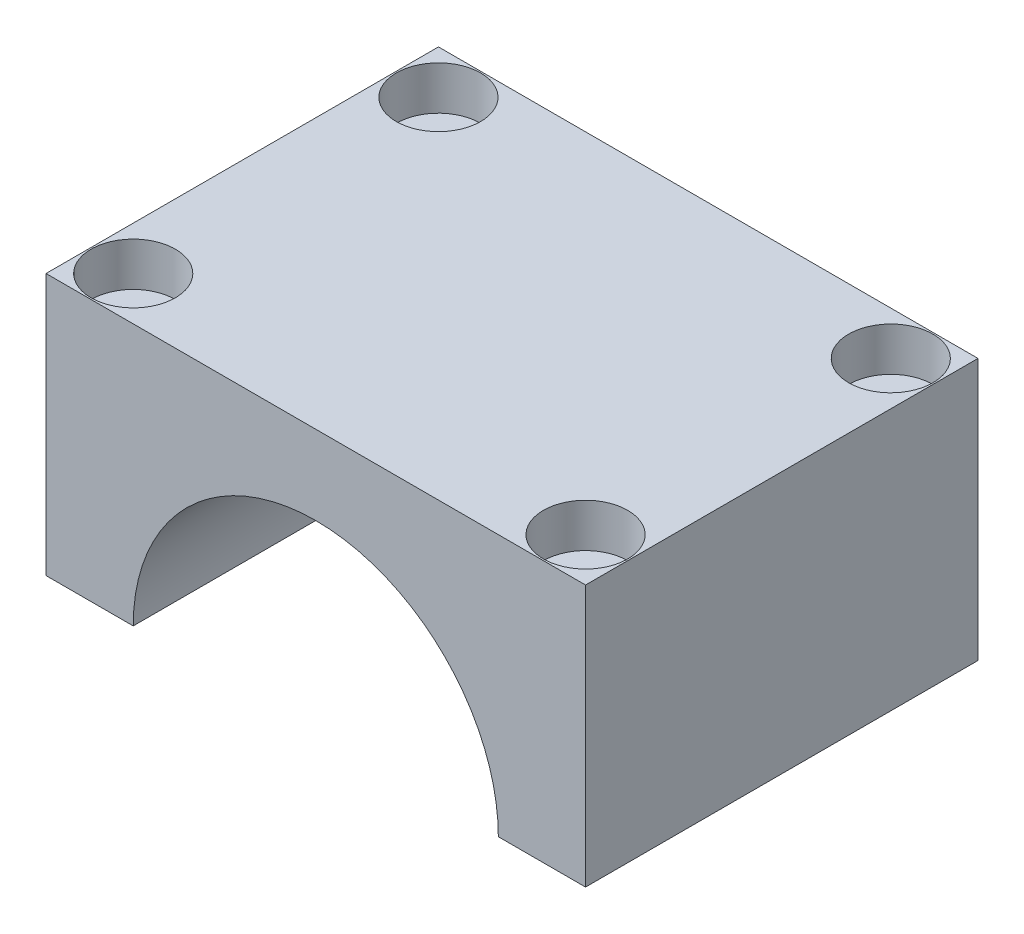
ISO-10303-21;
HEADER;
FILE_DESCRIPTION(('STEP AP214'),'2;1');
FILE_NAME('part.step','',(''),(''),'','','');
FILE_SCHEMA(('AUTOMOTIVE_DESIGN { 1 0 10303 214 1 1 1 1 }'));
ENDSEC;
DATA;
#1=APPLICATION_CONTEXT('core data for automotive mechanical design processes');
#2=APPLICATION_PROTOCOL_DEFINITION('international standard','automotive_design',2000,#1);
#3=PRODUCT_CONTEXT('',#1,'mechanical');
#4=PRODUCT('Part','Part','',(#3));
#5=PRODUCT_RELATED_PRODUCT_CATEGORY('part','',(#4));
#6=PRODUCT_DEFINITION_FORMATION('','',#4);
#7=PRODUCT_DEFINITION_CONTEXT('part definition',#1,'design');
#8=PRODUCT_DEFINITION('design','',#6,#7);
#9=PRODUCT_DEFINITION_SHAPE('','',#8);
#10=(LENGTH_UNIT() NAMED_UNIT(*) SI_UNIT(.MILLI.,.METRE.));
#11=(NAMED_UNIT(*) PLANE_ANGLE_UNIT() SI_UNIT($,.RADIAN.));
#12=(NAMED_UNIT(*) SI_UNIT($,.STERADIAN.) SOLID_ANGLE_UNIT());
#13=UNCERTAINTY_MEASURE_WITH_UNIT(LENGTH_MEASURE(1.E-05),#10,'distance_accuracy_value','');
#14=(GEOMETRIC_REPRESENTATION_CONTEXT(3) GLOBAL_UNCERTAINTY_ASSIGNED_CONTEXT((#13)) GLOBAL_UNIT_ASSIGNED_CONTEXT((#10,
#11,#12)) REPRESENTATION_CONTEXT('',''));
#15=CARTESIAN_POINT('',(0.,0.,0.));
#16=DIRECTION('',(0.,0.,1.));
#17=DIRECTION('',(1.,0.,0.));
#18=AXIS2_PLACEMENT_3D('',#15,#16,#17);
#19=CARTESIAN_POINT('',(-15.5600623846513,0.,24.));
#20=DIRECTION('',(0.,1.,0.));
#21=DIRECTION('',(0.,0.,1.));
#22=AXIS2_PLACEMENT_3D('',#19,#20,#21);
#23=CYLINDRICAL_SURFACE('',#22,1.3);
#24=CARTESIAN_POINT('',(-15.5600623846513,0.,24.));
#25=DIRECTION('',(0.,1.,0.));
#26=DIRECTION('',(0.,0.,1.));
#27=AXIS2_PLACEMENT_3D('',#24,#25,#26);
#28=CIRCLE('',#27,1.3);
#29=CARTESIAN_POINT('',(-15.5600623846513,0.,25.3));
#30=VERTEX_POINT('',#29);
#31=EDGE_CURVE('E140',#30,#30,#28,.T.);
#32=ORIENTED_EDGE('',*,*,#31,.F.);
#33=EDGE_LOOP('',(#32));
#34=FACE_BOUND('',#33,.T.);
#35=CARTESIAN_POINT('',(-15.5600623846513,15.,24.));
#36=DIRECTION('',(0.,1.,0.));
#37=DIRECTION('',(0.,0.,1.));
#38=AXIS2_PLACEMENT_3D('',#35,#36,#37);
#39=CIRCLE('',#38,1.3);
#40=CARTESIAN_POINT('',(-15.5600623846513,15.,25.3));
#41=VERTEX_POINT('',#40);
#42=EDGE_CURVE('E37',#41,#41,#39,.F.);
#43=ORIENTED_EDGE('',*,*,#42,.F.);
#44=EDGE_LOOP('',(#43));
#45=FACE_BOUND('',#44,.T.);
#46=ADVANCED_FACE('F33',(#34,#45),#23,.F.);
#47=CARTESIAN_POINT('',(15.5600623846513,0.,3.));
#48=DIRECTION('',(0.,1.,0.));
#49=DIRECTION('',(0.,0.,1.));
#50=AXIS2_PLACEMENT_3D('',#47,#48,#49);
#51=CYLINDRICAL_SURFACE('',#50,1.3);
#52=CARTESIAN_POINT('',(15.5600623846513,0.,3.));
#53=DIRECTION('',(0.,1.,0.));
#54=DIRECTION('',(0.,0.,1.));
#55=AXIS2_PLACEMENT_3D('',#52,#53,#54);
#56=CIRCLE('',#55,1.3);
#57=CARTESIAN_POINT('',(15.5600623846513,0.,4.3));
#58=VERTEX_POINT('',#57);
#59=EDGE_CURVE('E124',#58,#58,#56,.T.);
#60=ORIENTED_EDGE('',*,*,#59,.F.);
#61=EDGE_LOOP('',(#60));
#62=FACE_BOUND('',#61,.T.);
#63=CARTESIAN_POINT('',(15.5600623846513,15.,3.));
#64=DIRECTION('',(0.,1.,0.));
#65=DIRECTION('',(0.,0.,1.));
#66=AXIS2_PLACEMENT_3D('',#63,#64,#65);
#67=CIRCLE('',#66,1.3);
#68=CARTESIAN_POINT('',(15.5600623846513,15.,4.3));
#69=VERTEX_POINT('',#68);
#70=EDGE_CURVE('E137',#69,#69,#67,.F.);
#71=ORIENTED_EDGE('',*,*,#70,.F.);
#72=EDGE_LOOP('',(#71));
#73=FACE_BOUND('',#72,.T.);
#74=ADVANCED_FACE('F205',(#62,#73),#51,.F.);
#75=CARTESIAN_POINT('',(0.,0.,27.));
#76=DIRECTION('',(0.,0.,-1.));
#77=DIRECTION('',(-1.,0.,0.));
#78=AXIS2_PLACEMENT_3D('',#75,#76,#77);
#79=CYLINDRICAL_SURFACE('',#78,12.5600623846513);
#80=CARTESIAN_POINT('',(0.,0.,0.));
#81=DIRECTION('',(0.,0.,-1.));
#82=DIRECTION('',(-1.,0.,0.));
#83=AXIS2_PLACEMENT_3D('',#80,#81,#82);
#84=CIRCLE('',#83,12.5600623846513);
#85=CARTESIAN_POINT('',(-12.5600623846513,0.,0.));
#86=VERTEX_POINT('',#85);
#87=CARTESIAN_POINT('',(12.5600623846513,0.,0.));
#88=VERTEX_POINT('',#87);
#89=EDGE_CURVE('E120',#86,#88,#84,.T.);
#90=ORIENTED_EDGE('',*,*,#89,.T.);
#91=DIRECTION('',(0.,0.,-1.));
#92=VECTOR('',#91,1.);
#93=CARTESIAN_POINT('',(12.5600623846513,0.,27.));
#94=LINE('',#93,#92);
#95=CARTESIAN_POINT('',(12.5600623846513,0.,27.));
#96=VERTEX_POINT('',#95);
#97=EDGE_CURVE('E11',#96,#88,#94,.T.);
#98=ORIENTED_EDGE('',*,*,#97,.F.);
#99=CARTESIAN_POINT('',(0.,0.,27.));
#100=DIRECTION('',(0.,0.,-1.));
#101=DIRECTION('',(-1.,0.,0.));
#102=AXIS2_PLACEMENT_3D('',#99,#100,#101);
#103=CIRCLE('',#102,12.5600623846513);
#104=CARTESIAN_POINT('',(-12.5600623846513,0.,27.));
#105=VERTEX_POINT('',#104);
#106=EDGE_CURVE('E131',#105,#96,#103,.T.);
#107=ORIENTED_EDGE('',*,*,#106,.F.);
#108=DIRECTION('',(0.,0.,-1.));
#109=VECTOR('',#108,1.);
#110=CARTESIAN_POINT('',(-12.5600623846513,0.,27.));
#111=LINE('',#110,#109);
#112=EDGE_CURVE('E116',#105,#86,#111,.T.);
#113=ORIENTED_EDGE('',*,*,#112,.T.);
#114=EDGE_LOOP('',(#90,#98,#107,#113));
#115=FACE_BOUND('',#114,.T.);
#116=ADVANCED_FACE('F35',(#115),#79,.F.);
#117=CARTESIAN_POINT('',(12.5600623846513,0.,27.));
#118=DIRECTION('',(0.,1.,0.));
#119=DIRECTION('',(-1.,0.,0.));
#120=AXIS2_PLACEMENT_3D('',#117,#118,#119);
#121=PLANE('',#120);
#122=CARTESIAN_POINT('',(15.5600623846513,0.,24.));
#123=DIRECTION('',(0.,1.,0.));
#124=DIRECTION('',(0.,0.,-1.));
#125=AXIS2_PLACEMENT_3D('',#122,#123,#124);
#126=CIRCLE('',#125,1.3);
#127=CARTESIAN_POINT('',(15.5600623846513,0.,22.7));
#128=VERTEX_POINT('',#127);
#129=EDGE_CURVE('E176',#128,#128,#126,.T.);
#130=ORIENTED_EDGE('',*,*,#129,.T.);
#131=EDGE_LOOP('',(#130));
#132=FACE_BOUND('',#131,.T.);
#133=ORIENTED_EDGE('',*,*,#59,.T.);
#134=EDGE_LOOP('',(#133));
#135=FACE_BOUND('',#134,.T.);
#136=DIRECTION('',(1.,0.,0.));
#137=VECTOR('',#136,1.);
#138=CARTESIAN_POINT('',(12.5600623846513,0.,0.));
#139=LINE('',#138,#137);
#140=CARTESIAN_POINT('',(18.5600623846513,0.,0.));
#141=VERTEX_POINT('',#140);
#142=EDGE_CURVE('E123',#88,#141,#139,.T.);
#143=ORIENTED_EDGE('',*,*,#142,.T.);
#144=DIRECTION('',(0.,0.,-1.));
#145=VECTOR('',#144,1.);
#146=CARTESIAN_POINT('',(18.5600623846513,0.,27.));
#147=LINE('',#146,#145);
#148=CARTESIAN_POINT('',(18.5600623846513,0.,27.));
#149=VERTEX_POINT('',#148);
#150=EDGE_CURVE('E43',#149,#141,#147,.T.);
#151=ORIENTED_EDGE('',*,*,#150,.F.);
#152=DIRECTION('',(1.,0.,0.));
#153=VECTOR('',#152,1.);
#154=CARTESIAN_POINT('',(12.5600623846513,0.,27.));
#155=LINE('',#154,#153);
#156=EDGE_CURVE('E89',#96,#149,#155,.T.);
#157=ORIENTED_EDGE('',*,*,#156,.F.);
#158=ORIENTED_EDGE('',*,*,#97,.T.);
#159=EDGE_LOOP('',(#143,#151,#157,#158));
#160=FACE_BOUND('',#159,.T.);
#161=ADVANCED_FACE('F184',(#132,#135,#160),#121,.F.);
#162=CARTESIAN_POINT('',(18.5600623846513,0.,27.));
#163=DIRECTION('',(-1.,0.,0.));
#164=DIRECTION('',(0.,0.,1.));
#165=AXIS2_PLACEMENT_3D('',#162,#163,#164);
#166=PLANE('',#165);
#167=DIRECTION('',(0.,1.,0.));
#168=VECTOR('',#167,1.);
#169=CARTESIAN_POINT('',(18.5600623846513,0.,0.));
#170=LINE('',#169,#168);
#171=CARTESIAN_POINT('',(18.5600623846513,18.,0.));
#172=VERTEX_POINT('',#171);
#173=EDGE_CURVE('E126',#141,#172,#170,.T.);
#174=ORIENTED_EDGE('',*,*,#173,.T.);
#175=DIRECTION('',(0.,0.,-1.));
#176=VECTOR('',#175,1.);
#177=CARTESIAN_POINT('',(18.5600623846513,18.,27.));
#178=LINE('',#177,#176);
#179=CARTESIAN_POINT('',(18.5600623846513,18.,27.));
#180=VERTEX_POINT('',#179);
#181=EDGE_CURVE('E111',#180,#172,#178,.T.);
#182=ORIENTED_EDGE('',*,*,#181,.F.);
#183=DIRECTION('',(0.,1.,0.));
#184=VECTOR('',#183,1.);
#185=CARTESIAN_POINT('',(18.5600623846513,0.,27.));
#186=LINE('',#185,#184);
#187=EDGE_CURVE('E102',#149,#180,#186,.T.);
#188=ORIENTED_EDGE('',*,*,#187,.F.);
#189=ORIENTED_EDGE('',*,*,#150,.T.);
#190=EDGE_LOOP('',(#174,#182,#188,#189));
#191=FACE_BOUND('',#190,.T.);
#192=ADVANCED_FACE('F187',(#191),#166,.F.);
#193=CARTESIAN_POINT('',(-18.5600623846513,18.,27.));
#194=DIRECTION('',(0.,-1.,0.));
#195=DIRECTION('',(0.,0.,-1.));
#196=AXIS2_PLACEMENT_3D('',#193,#194,#195);
#197=PLANE('',#196);
#198=CARTESIAN_POINT('',(-15.5600623846513,18.,24.));
#199=DIRECTION('',(0.,1.,0.));
#200=DIRECTION('',(0.,0.,1.));
#201=AXIS2_PLACEMENT_3D('',#198,#199,#200);
#202=CIRCLE('',#201,2.9);
#203=CARTESIAN_POINT('',(-15.5600623846513,18.,26.9));
#204=VERTEX_POINT('',#203);
#205=EDGE_CURVE('E162',#204,#204,#202,.T.);
#206=ORIENTED_EDGE('',*,*,#205,.F.);
#207=EDGE_LOOP('',(#206));
#208=FACE_BOUND('',#207,.T.);
#209=CARTESIAN_POINT('',(-15.5600623846513,18.,3.));
#210=DIRECTION('',(0.,1.,0.));
#211=DIRECTION('',(0.,0.,-1.));
#212=AXIS2_PLACEMENT_3D('',#209,#210,#211);
#213=CIRCLE('',#212,2.9);
#214=CARTESIAN_POINT('',(-15.5600623846513,18.,0.100000000000003));
#215=VERTEX_POINT('',#214);
#216=EDGE_CURVE('E155',#215,#215,#213,.T.);
#217=ORIENTED_EDGE('',*,*,#216,.F.);
#218=EDGE_LOOP('',(#217));
#219=FACE_BOUND('',#218,.T.);
#220=CARTESIAN_POINT('',(15.5600623846513,18.,24.));
#221=DIRECTION('',(0.,1.,0.));
#222=DIRECTION('',(0.,0.,-1.));
#223=AXIS2_PLACEMENT_3D('',#220,#221,#222);
#224=CIRCLE('',#223,2.9);
#225=CARTESIAN_POINT('',(15.5600623846513,18.,21.1));
#226=VERTEX_POINT('',#225);
#227=EDGE_CURVE('E148',#226,#226,#224,.T.);
#228=ORIENTED_EDGE('',*,*,#227,.F.);
#229=EDGE_LOOP('',(#228));
#230=FACE_BOUND('',#229,.T.);
#231=CARTESIAN_POINT('',(15.5600623846513,18.,3.));
#232=DIRECTION('',(0.,1.,0.));
#233=DIRECTION('',(0.,0.,1.));
#234=AXIS2_PLACEMENT_3D('',#231,#232,#233);
#235=CIRCLE('',#234,2.9);
#236=CARTESIAN_POINT('',(15.5600623846513,18.,5.9));
#237=VERTEX_POINT('',#236);
#238=EDGE_CURVE('E144',#237,#237,#235,.T.);
#239=ORIENTED_EDGE('',*,*,#238,.F.);
#240=EDGE_LOOP('',(#239));
#241=FACE_BOUND('',#240,.T.);
#242=DIRECTION('',(-1.,0.,0.));
#243=VECTOR('',#242,1.);
#244=CARTESIAN_POINT('',(-18.5600623846513,18.,0.));
#245=LINE('',#244,#243);
#246=CARTESIAN_POINT('',(-18.5600623846513,18.,0.));
#247=VERTEX_POINT('',#246);
#248=EDGE_CURVE('E110',#172,#247,#245,.T.);
#249=ORIENTED_EDGE('',*,*,#248,.T.);
#250=DIRECTION('',(0.,0.,-1.));
#251=VECTOR('',#250,1.);
#252=CARTESIAN_POINT('',(-18.5600623846513,18.,27.));
#253=LINE('',#252,#251);
#254=CARTESIAN_POINT('',(-18.5600623846513,18.,27.));
#255=VERTEX_POINT('',#254);
#256=EDGE_CURVE('E107',#255,#247,#253,.T.);
#257=ORIENTED_EDGE('',*,*,#256,.F.);
#258=DIRECTION('',(-1.,0.,0.));
#259=VECTOR('',#258,1.);
#260=CARTESIAN_POINT('',(-18.5600623846513,18.,27.));
#261=LINE('',#260,#259);
#262=EDGE_CURVE('E96',#180,#255,#261,.T.);
#263=ORIENTED_EDGE('',*,*,#262,.F.);
#264=ORIENTED_EDGE('',*,*,#181,.T.);
#265=EDGE_LOOP('',(#249,#257,#263,#264));
#266=FACE_BOUND('',#265,.T.);
#267=ADVANCED_FACE('F108',(#208,#219,#230,#241,#266),#197,.F.);
#268=CARTESIAN_POINT('',(-18.5600623846513,0.,27.));
#269=DIRECTION('',(1.,0.,0.));
#270=DIRECTION('',(0.,0.,-1.));
#271=AXIS2_PLACEMENT_3D('',#268,#269,#270);
#272=PLANE('',#271);
#273=DIRECTION('',(0.,-1.,0.));
#274=VECTOR('',#273,1.);
#275=CARTESIAN_POINT('',(-18.5600623846513,0.,0.));
#276=LINE('',#275,#274);
#277=CARTESIAN_POINT('',(-18.5600623846513,0.,0.));
#278=VERTEX_POINT('',#277);
#279=EDGE_CURVE('E75',#247,#278,#276,.T.);
#280=ORIENTED_EDGE('',*,*,#279,.T.);
#281=DIRECTION('',(0.,0.,-1.));
#282=VECTOR('',#281,1.);
#283=CARTESIAN_POINT('',(-18.5600623846513,0.,27.));
#284=LINE('',#283,#282);
#285=CARTESIAN_POINT('',(-18.5600623846513,0.,27.));
#286=VERTEX_POINT('',#285);
#287=EDGE_CURVE('E112',#286,#278,#284,.T.);
#288=ORIENTED_EDGE('',*,*,#287,.F.);
#289=DIRECTION('',(0.,-1.,0.));
#290=VECTOR('',#289,1.);
#291=CARTESIAN_POINT('',(-18.5600623846513,0.,27.));
#292=LINE('',#291,#290);
#293=EDGE_CURVE('E100',#255,#286,#292,.T.);
#294=ORIENTED_EDGE('',*,*,#293,.F.);
#295=ORIENTED_EDGE('',*,*,#256,.T.);
#296=EDGE_LOOP('',(#280,#288,#294,#295));
#297=FACE_BOUND('',#296,.T.);
#298=ADVANCED_FACE('F114',(#297),#272,.F.);
#299=CARTESIAN_POINT('',(-12.5600623846513,0.,27.));
#300=DIRECTION('',(0.,1.,0.));
#301=DIRECTION('',(-1.,0.,0.));
#302=AXIS2_PLACEMENT_3D('',#299,#300,#301);
#303=PLANE('',#302);
#304=ORIENTED_EDGE('',*,*,#31,.T.);
#305=EDGE_LOOP('',(#304));
#306=FACE_BOUND('',#305,.T.);
#307=CARTESIAN_POINT('',(-15.5600623846513,0.,3.));
#308=DIRECTION('',(0.,1.,0.));
#309=DIRECTION('',(0.,0.,-1.));
#310=AXIS2_PLACEMENT_3D('',#307,#308,#309);
#311=CIRCLE('',#310,1.3);
#312=CARTESIAN_POINT('',(-15.5600623846513,0.,1.7));
#313=VERTEX_POINT('',#312);
#314=EDGE_CURVE('E173',#313,#313,#311,.T.);
#315=ORIENTED_EDGE('',*,*,#314,.T.);
#316=EDGE_LOOP('',(#315));
#317=FACE_BOUND('',#316,.T.);
#318=DIRECTION('',(1.,0.,0.));
#319=VECTOR('',#318,1.);
#320=CARTESIAN_POINT('',(-12.5600623846513,0.,0.));
#321=LINE('',#320,#319);
#322=EDGE_CURVE('E81',#278,#86,#321,.T.);
#323=ORIENTED_EDGE('',*,*,#322,.T.);
#324=ORIENTED_EDGE('',*,*,#112,.F.);
#325=DIRECTION('',(1.,0.,0.));
#326=VECTOR('',#325,1.);
#327=CARTESIAN_POINT('',(-12.5600623846513,0.,27.));
#328=LINE('',#327,#326);
#329=EDGE_CURVE('E52',#286,#105,#328,.T.);
#330=ORIENTED_EDGE('',*,*,#329,.F.);
#331=ORIENTED_EDGE('',*,*,#287,.T.);
#332=EDGE_LOOP('',(#323,#324,#330,#331));
#333=FACE_BOUND('',#332,.T.);
#334=ADVANCED_FACE('F192',(#306,#317,#333),#303,.F.);
#335=CARTESIAN_POINT('',(0.,0.,27.));
#336=DIRECTION('',(0.,0.,-1.));
#337=DIRECTION('',(-1.,0.,0.));
#338=AXIS2_PLACEMENT_3D('',#335,#336,#337);
#339=PLANE('',#338);
#340=ORIENTED_EDGE('',*,*,#106,.T.);
#341=ORIENTED_EDGE('',*,*,#156,.T.);
#342=ORIENTED_EDGE('',*,*,#187,.T.);
#343=ORIENTED_EDGE('',*,*,#262,.T.);
#344=ORIENTED_EDGE('',*,*,#293,.T.);
#345=ORIENTED_EDGE('',*,*,#329,.T.);
#346=EDGE_LOOP('',(#340,#341,#342,#343,#344,#345));
#347=FACE_BOUND('',#346,.T.);
#348=ADVANCED_FACE('F98',(#347),#339,.F.);
#349=CARTESIAN_POINT('',(0.,0.,0.));
#350=DIRECTION('',(0.,0.,-1.));
#351=DIRECTION('',(-1.,0.,0.));
#352=AXIS2_PLACEMENT_3D('',#349,#350,#351);
#353=PLANE('',#352);
#354=ORIENTED_EDGE('',*,*,#89,.F.);
#355=ORIENTED_EDGE('',*,*,#322,.F.);
#356=ORIENTED_EDGE('',*,*,#279,.F.);
#357=ORIENTED_EDGE('',*,*,#248,.F.);
#358=ORIENTED_EDGE('',*,*,#173,.F.);
#359=ORIENTED_EDGE('',*,*,#142,.F.);
#360=EDGE_LOOP('',(#354,#355,#356,#357,#358,#359));
#361=FACE_BOUND('',#360,.T.);
#362=ADVANCED_FACE('F190',(#361),#353,.T.);
#363=CARTESIAN_POINT('',(15.5600623846513,0.,24.));
#364=DIRECTION('',(0.,1.,0.));
#365=DIRECTION('',(0.,0.,1.));
#366=AXIS2_PLACEMENT_3D('',#363,#364,#365);
#367=CYLINDRICAL_SURFACE('',#366,1.3);
#368=CARTESIAN_POINT('',(15.5600623846513,15.,24.));
#369=DIRECTION('',(0.,-1.,0.));
#370=DIRECTION('',(0.,0.,-1.));
#371=AXIS2_PLACEMENT_3D('',#368,#369,#370);
#372=CIRCLE('',#371,1.3);
#373=CARTESIAN_POINT('',(15.5600623846513,15.,22.7));
#374=VERTEX_POINT('',#373);
#375=EDGE_CURVE('E142',#374,#374,#372,.F.);
#376=ORIENTED_EDGE('',*,*,#375,.T.);
#377=EDGE_LOOP('',(#376));
#378=FACE_BOUND('',#377,.T.);
#379=ORIENTED_EDGE('',*,*,#129,.F.);
#380=EDGE_LOOP('',(#379));
#381=FACE_BOUND('',#380,.T.);
#382=ADVANCED_FACE('F223',(#378,#381),#367,.F.);
#383=CARTESIAN_POINT('',(-15.5600623846513,0.,3.));
#384=DIRECTION('',(0.,1.,0.));
#385=DIRECTION('',(0.,0.,1.));
#386=AXIS2_PLACEMENT_3D('',#383,#384,#385);
#387=CYLINDRICAL_SURFACE('',#386,1.3);
#388=CARTESIAN_POINT('',(-15.5600623846513,15.,3.));
#389=DIRECTION('',(0.,-1.,0.));
#390=DIRECTION('',(0.,0.,-1.));
#391=AXIS2_PLACEMENT_3D('',#388,#389,#390);
#392=CIRCLE('',#391,1.3);
#393=CARTESIAN_POINT('',(-15.5600623846513,15.,1.7));
#394=VERTEX_POINT('',#393);
#395=EDGE_CURVE('E146',#394,#394,#392,.F.);
#396=ORIENTED_EDGE('',*,*,#395,.T.);
#397=EDGE_LOOP('',(#396));
#398=FACE_BOUND('',#397,.T.);
#399=ORIENTED_EDGE('',*,*,#314,.F.);
#400=EDGE_LOOP('',(#399));
#401=FACE_BOUND('',#400,.T.);
#402=ADVANCED_FACE('F219',(#398,#401),#387,.F.);
#403=CARTESIAN_POINT('',(15.5600623846513,15.,3.));
#404=DIRECTION('',(0.,1.,0.));
#405=DIRECTION('',(0.,0.,1.));
#406=AXIS2_PLACEMENT_3D('',#403,#404,#405);
#407=PLANE('',#406);
#408=CARTESIAN_POINT('',(15.5600623846513,15.,3.));
#409=DIRECTION('',(0.,1.,0.));
#410=DIRECTION('',(0.,0.,1.));
#411=AXIS2_PLACEMENT_3D('',#408,#409,#410);
#412=CIRCLE('',#411,2.9);
#413=CARTESIAN_POINT('',(15.5600623846513,15.,5.9));
#414=VERTEX_POINT('',#413);
#415=EDGE_CURVE('E141',#414,#414,#412,.T.);
#416=ORIENTED_EDGE('',*,*,#415,.T.);
#417=EDGE_LOOP('',(#416));
#418=FACE_BOUND('',#417,.T.);
#419=ORIENTED_EDGE('',*,*,#70,.T.);
#420=EDGE_LOOP('',(#419));
#421=FACE_BOUND('',#420,.T.);
#422=ADVANCED_FACE('F222',(#418,#421),#407,.T.);
#423=CARTESIAN_POINT('',(15.5600623846513,15.,3.));
#424=DIRECTION('',(0.,1.,0.));
#425=DIRECTION('',(0.,0.,1.));
#426=AXIS2_PLACEMENT_3D('',#423,#424,#425);
#427=CYLINDRICAL_SURFACE('',#426,2.9);
#428=ORIENTED_EDGE('',*,*,#415,.F.);
#429=EDGE_LOOP('',(#428));
#430=FACE_BOUND('',#429,.T.);
#431=ORIENTED_EDGE('',*,*,#238,.T.);
#432=EDGE_LOOP('',(#431));
#433=FACE_BOUND('',#432,.T.);
#434=ADVANCED_FACE('F217',(#430,#433),#427,.F.);
#435=CARTESIAN_POINT('',(15.5600623846513,15.,24.));
#436=DIRECTION('',(0.,-1.,0.));
#437=DIRECTION('',(0.,0.,-1.));
#438=AXIS2_PLACEMENT_3D('',#435,#436,#437);
#439=PLANE('',#438);
#440=CARTESIAN_POINT('',(15.5600623846513,15.,24.));
#441=DIRECTION('',(0.,1.,0.));
#442=DIRECTION('',(0.,0.,-1.));
#443=AXIS2_PLACEMENT_3D('',#440,#441,#442);
#444=CIRCLE('',#443,2.9);
#445=CARTESIAN_POINT('',(15.5600623846513,15.,21.1));
#446=VERTEX_POINT('',#445);
#447=EDGE_CURVE('E145',#446,#446,#444,.T.);
#448=ORIENTED_EDGE('',*,*,#447,.T.);
#449=EDGE_LOOP('',(#448));
#450=FACE_BOUND('',#449,.T.);
#451=ORIENTED_EDGE('',*,*,#375,.F.);
#452=EDGE_LOOP('',(#451));
#453=FACE_BOUND('',#452,.T.);
#454=ADVANCED_FACE('F253',(#450,#453),#439,.F.);
#455=CARTESIAN_POINT('',(15.5600623846513,15.,24.));
#456=DIRECTION('',(0.,1.,0.));
#457=DIRECTION('',(0.,0.,1.));
#458=AXIS2_PLACEMENT_3D('',#455,#456,#457);
#459=CYLINDRICAL_SURFACE('',#458,2.9);
#460=ORIENTED_EDGE('',*,*,#447,.F.);
#461=EDGE_LOOP('',(#460));
#462=FACE_BOUND('',#461,.T.);
#463=ORIENTED_EDGE('',*,*,#227,.T.);
#464=EDGE_LOOP('',(#463));
#465=FACE_BOUND('',#464,.T.);
#466=ADVANCED_FACE('F260',(#462,#465),#459,.F.);
#467=CARTESIAN_POINT('',(-15.5600623846513,15.,3.));
#468=DIRECTION('',(0.,-1.,0.));
#469=DIRECTION('',(0.,0.,-1.));
#470=AXIS2_PLACEMENT_3D('',#467,#468,#469);
#471=PLANE('',#470);
#472=CARTESIAN_POINT('',(-15.5600623846513,15.,3.));
#473=DIRECTION('',(0.,1.,0.));
#474=DIRECTION('',(0.,0.,-1.));
#475=AXIS2_PLACEMENT_3D('',#472,#473,#474);
#476=CIRCLE('',#475,2.9);
#477=CARTESIAN_POINT('',(-15.5600623846513,15.,0.100000000000003));
#478=VERTEX_POINT('',#477);
#479=EDGE_CURVE('E149',#478,#478,#476,.T.);
#480=ORIENTED_EDGE('',*,*,#479,.T.);
#481=EDGE_LOOP('',(#480));
#482=FACE_BOUND('',#481,.T.);
#483=ORIENTED_EDGE('',*,*,#395,.F.);
#484=EDGE_LOOP('',(#483));
#485=FACE_BOUND('',#484,.T.);
#486=ADVANCED_FACE('F268',(#482,#485),#471,.F.);
#487=CARTESIAN_POINT('',(-15.5600623846513,15.,3.));
#488=DIRECTION('',(0.,1.,0.));
#489=DIRECTION('',(0.,0.,1.));
#490=AXIS2_PLACEMENT_3D('',#487,#488,#489);
#491=CYLINDRICAL_SURFACE('',#490,2.9);
#492=ORIENTED_EDGE('',*,*,#479,.F.);
#493=EDGE_LOOP('',(#492));
#494=FACE_BOUND('',#493,.T.);
#495=ORIENTED_EDGE('',*,*,#216,.T.);
#496=EDGE_LOOP('',(#495));
#497=FACE_BOUND('',#496,.T.);
#498=ADVANCED_FACE('F276',(#494,#497),#491,.F.);
#499=CARTESIAN_POINT('',(-15.5600623846513,15.,24.));
#500=DIRECTION('',(0.,1.,0.));
#501=DIRECTION('',(0.,0.,1.));
#502=AXIS2_PLACEMENT_3D('',#499,#500,#501);
#503=PLANE('',#502);
#504=CARTESIAN_POINT('',(-15.5600623846513,15.,24.));
#505=DIRECTION('',(0.,1.,0.));
#506=DIRECTION('',(0.,0.,1.));
#507=AXIS2_PLACEMENT_3D('',#504,#505,#506);
#508=CIRCLE('',#507,2.9);
#509=CARTESIAN_POINT('',(-15.5600623846513,15.,26.9));
#510=VERTEX_POINT('',#509);
#511=EDGE_CURVE('E397',#510,#510,#508,.T.);
#512=ORIENTED_EDGE('',*,*,#511,.T.);
#513=EDGE_LOOP('',(#512));
#514=FACE_BOUND('',#513,.T.);
#515=ORIENTED_EDGE('',*,*,#42,.T.);
#516=EDGE_LOOP('',(#515));
#517=FACE_BOUND('',#516,.T.);
#518=ADVANCED_FACE('F283',(#514,#517),#503,.T.);
#519=CARTESIAN_POINT('',(-15.5600623846513,15.,24.));
#520=DIRECTION('',(0.,1.,0.));
#521=DIRECTION('',(0.,0.,1.));
#522=AXIS2_PLACEMENT_3D('',#519,#520,#521);
#523=CYLINDRICAL_SURFACE('',#522,2.9);
#524=ORIENTED_EDGE('',*,*,#511,.F.);
#525=EDGE_LOOP('',(#524));
#526=FACE_BOUND('',#525,.T.);
#527=ORIENTED_EDGE('',*,*,#205,.T.);
#528=EDGE_LOOP('',(#527));
#529=FACE_BOUND('',#528,.T.);
#530=ADVANCED_FACE('F291',(#526,#529),#523,.F.);
#531=CLOSED_SHELL('',(#46,#74,#116,#161,#192,#267,#298,#334,#348,#362,#382,#402,#422,#434,#454,
#466,#486,#498,#518,#530));
#532=MANIFOLD_SOLID_BREP('B2',#531);
#533=ADVANCED_BREP_SHAPE_REPRESENTATION('',(#18,#532),#14);
#534=SHAPE_DEFINITION_REPRESENTATION(#9,#533);
ENDSEC;
END-ISO-10303-21;
